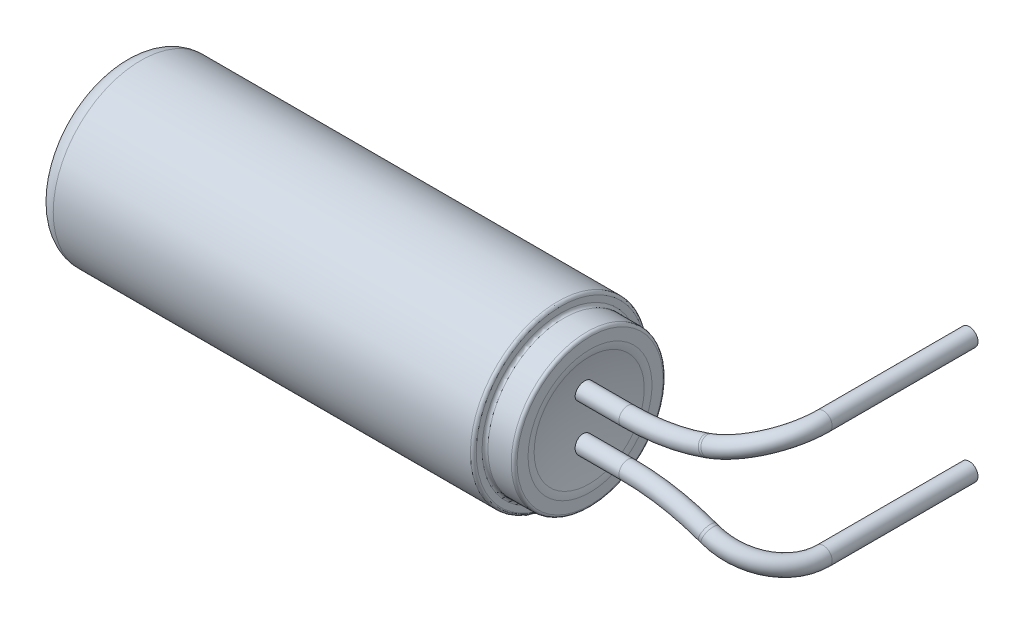
ISO-10303-21;
HEADER;
FILE_DESCRIPTION(('STEP AP214'),'2;1');
FILE_NAME('part.step','',(''),(''),'','','');
FILE_SCHEMA(('AUTOMOTIVE_DESIGN { 1 0 10303 214 1 1 1 1 }'));
ENDSEC;
DATA;
#1=APPLICATION_CONTEXT('core data for automotive mechanical design processes');
#2=APPLICATION_PROTOCOL_DEFINITION('international standard','automotive_design',2000,#1);
#3=PRODUCT_CONTEXT('',#1,'mechanical');
#4=PRODUCT('Part','Part','',(#3));
#5=PRODUCT_RELATED_PRODUCT_CATEGORY('part','',(#4));
#6=PRODUCT_DEFINITION_FORMATION('','',#4);
#7=PRODUCT_DEFINITION_CONTEXT('part definition',#1,'design');
#8=PRODUCT_DEFINITION('design','',#6,#7);
#9=PRODUCT_DEFINITION_SHAPE('','',#8);
#10=(LENGTH_UNIT() NAMED_UNIT(*) SI_UNIT(.MILLI.,.METRE.));
#11=(NAMED_UNIT(*) PLANE_ANGLE_UNIT() SI_UNIT($,.RADIAN.));
#12=(NAMED_UNIT(*) SI_UNIT($,.STERADIAN.) SOLID_ANGLE_UNIT());
#13=UNCERTAINTY_MEASURE_WITH_UNIT(LENGTH_MEASURE(1.E-05),#10,'distance_accuracy_value','');
#14=(GEOMETRIC_REPRESENTATION_CONTEXT(3) GLOBAL_UNCERTAINTY_ASSIGNED_CONTEXT((#13)) GLOBAL_UNIT_ASSIGNED_CONTEXT((#10,
#11,#12)) REPRESENTATION_CONTEXT('',''));
#15=CARTESIAN_POINT('',(0.,0.,0.));
#16=DIRECTION('',(0.,0.,1.));
#17=DIRECTION('',(1.,0.,0.));
#18=AXIS2_PLACEMENT_3D('',#15,#16,#17);
#19=CARTESIAN_POINT('',(-10.7,0.,1.5));
#20=DIRECTION('',(-1.,0.,0.));
#21=DIRECTION('',(0.,0.,1.));
#22=AXIS2_PLACEMENT_3D('',#19,#20,#21);
#23=TOROIDAL_SURFACE('',#22,1.2,0.3);
#24=CARTESIAN_POINT('',(-10.7,0.,1.5));
#25=DIRECTION('',(-1.,0.,0.));
#26=DIRECTION('',(0.,0.,1.));
#27=AXIS2_PLACEMENT_3D('',#24,#25,#26);
#28=CIRCLE('',#27,1.5);
#29=CARTESIAN_POINT('',(-10.7,0.,3.));
#30=VERTEX_POINT('',#29);
#31=EDGE_CURVE('E80',#30,#30,#28,.T.);
#32=ORIENTED_EDGE('',*,*,#31,.T.);
#33=EDGE_LOOP('',(#32));
#34=FACE_BOUND('',#33,.T.);
#35=CARTESIAN_POINT('',(-11.,0.,1.5));
#36=DIRECTION('',(-1.,0.,0.));
#37=DIRECTION('',(0.,0.,1.));
#38=AXIS2_PLACEMENT_3D('',#35,#36,#37);
#39=CIRCLE('',#38,1.2);
#40=CARTESIAN_POINT('',(-11.,0.,2.7));
#41=VERTEX_POINT('',#40);
#42=EDGE_CURVE('E107',#41,#41,#39,.T.);
#43=ORIENTED_EDGE('',*,*,#42,.F.);
#44=EDGE_LOOP('',(#43));
#45=FACE_BOUND('',#44,.T.);
#46=ADVANCED_FACE('F37',(#34,#45),#23,.T.);
#47=CARTESIAN_POINT('',(-11.,0.,2.7));
#48=DIRECTION('',(-1.,0.,0.));
#49=DIRECTION('',(0.,0.,1.));
#50=AXIS2_PLACEMENT_3D('',#47,#48,#49);
#51=PLANE('',#50);
#52=ORIENTED_EDGE('',*,*,#42,.T.);
#53=EDGE_LOOP('',(#52));
#54=FACE_BOUND('',#53,.T.);
#55=ADVANCED_FACE('F176',(#54),#51,.T.);
#56=CARTESIAN_POINT('',(0.872983346207417,0.,1.5));
#57=DIRECTION('',(-1.,0.,0.));
#58=DIRECTION('',(0.,0.,1.));
#59=AXIS2_PLACEMENT_3D('',#56,#57,#58);
#60=SPHERICAL_SURFACE('',#59,4.);
#61=CARTESIAN_POINT('',(-3.09334051928466,-0.507218742534798,1.39509937440816));
#62=CARTESIAN_POINT('',(-3.09393685361292,-0.501305603432375,1.38905611296728));
#63=CARTESIAN_POINT('',(-3.09458489583757,-0.49487840158325,1.38351201035815));
#64=CARTESIAN_POINT('',(-3.09596541710744,-0.4811827386441,1.37358373849689));
#65=CARTESIAN_POINT('',(-3.0966980019741,-0.473913223189062,1.36920104608264));
#66=CARTESIAN_POINT('',(-3.09822560482298,-0.458750061738159,1.36172563136943));
#67=CARTESIAN_POINT('',(-3.09902058119486,-0.450856831688512,1.35863205786989));
#68=CARTESIAN_POINT('',(-3.1006504590062,-0.434668807085768,1.35381731161488));
#69=CARTESIAN_POINT('',(-3.10148535035421,-0.426374114025604,1.35209579389564));
#70=CARTESIAN_POINT('',(-3.10317415945367,-0.409590256308292,1.35006773309764));
#71=CARTESIAN_POINT('',(-3.10402812601833,-0.40110059065062,1.34976537422038));
#72=CARTESIAN_POINT('',(-3.10572854587596,-0.384190503562251,1.35059542925992));
#73=CARTESIAN_POINT('',(-3.1065749987697,-0.375770085812762,1.35172791896312));
#74=CARTESIAN_POINT('',(-3.10823742791311,-0.359227299775291,1.35539896819881));
#75=CARTESIAN_POINT('',(-3.1090533653927,-0.351105310858813,1.35793925562216));
#76=CARTESIAN_POINT('',(-3.11063045217837,-0.335402159674445,1.36435686295868));
#77=CARTESIAN_POINT('',(-3.11139160193495,-0.327820992959561,1.36823417187646));
#78=CARTESIAN_POINT('',(-3.11283591393656,-0.313431683414022,1.37720878632798));
#79=CARTESIAN_POINT('',(-3.11351922852225,-0.306622030704726,1.38230364608068));
#80=CARTESIAN_POINT('',(-3.11479000338356,-0.293955146118108,1.39357465127481));
#81=CARTESIAN_POINT('',(-3.11537746592087,-0.288097891768141,1.39975077119585));
#82=CARTESIAN_POINT('',(-3.1164372292288,-0.277529690873863,1.41298051456669));
#83=CARTESIAN_POINT('',(-3.11691002022661,-0.27281386484495,1.4200302007101));
#84=CARTESIAN_POINT('',(-3.11773005314371,-0.264633416418267,1.43482824809174));
#85=CARTESIAN_POINT('',(-3.11807729837158,-0.261168761047602,1.44257659091109));
#86=CARTESIAN_POINT('',(-3.11863478318374,-0.255605983704369,1.45851205277183));
#87=CARTESIAN_POINT('',(-3.11884567140727,-0.253501392044791,1.46669689095527));
#88=CARTESIAN_POINT('',(-3.11912696005609,-0.250694153424214,1.48330586232269));
#89=CARTESIAN_POINT('',(-3.11919736349164,-0.249991476423336,1.49172999037531));
#90=CARTESIAN_POINT('',(-3.11919564242301,-0.250008653384269,1.50855030235141));
#91=CARTESIAN_POINT('',(-3.11912396318907,-0.250724063230081,1.51694649123628));
#92=CARTESIAN_POINT('',(-3.11884104456068,-0.253547566284006,1.53349883451104));
#93=CARTESIAN_POINT('',(-3.11862980592329,-0.255655651937392,1.54165499020276));
#94=CARTESIAN_POINT('',(-3.11807389713144,-0.261202696371296,1.55749542622673));
#95=CARTESIAN_POINT('',(-3.11772924203568,-0.26464150495324,1.56517975970013));
#96=CARTESIAN_POINT('',(-3.11691638855127,-0.272750338835129,1.5798614630305));
#97=CARTESIAN_POINT('',(-3.11644818870354,-0.27742037867619,1.58685882477284));
#98=CARTESIAN_POINT('',(-3.11540003393559,-0.287872859536257,1.59999067770041));
#99=CARTESIAN_POINT('',(-3.1148197546915,-0.293658528766541,1.60612257313213));
#100=CARTESIAN_POINT('',(-3.11356480754707,-0.306167763427729,1.61732873409954));
#101=CARTESIAN_POINT('',(-3.11289013737699,-0.312891351411894,1.62240297419547));
#102=CARTESIAN_POINT('',(-3.11146203414788,-0.327119403044731,1.63137535990459));
#103=CARTESIAN_POINT('',(-3.11070824457522,-0.334627400488884,1.63526784496861));
#104=CARTESIAN_POINT('',(-3.10914581449248,-0.35018494660467,1.64173721747279));
#105=CARTESIAN_POINT('',(-3.10833717256312,-0.358234509289021,1.64431407085684));
#106=CARTESIAN_POINT('',(-3.1066840371301,-0.374685254772762,1.64809017558273));
#107=CARTESIAN_POINT('',(-3.105839399731,-0.383087846486268,1.64928322752164));
#108=CARTESIAN_POINT('',(-3.10414151852325,-0.399973163756694,1.65023817509612));
#109=CARTESIAN_POINT('',(-3.10328827456612,-0.408455890695997,1.65000004599775));
#110=CARTESIAN_POINT('',(-3.10159536836937,-0.425280949843948,1.64809696161685));
#111=CARTESIAN_POINT('',(-3.1007557413197,-0.433622920027478,1.64642877170701));
#112=CARTESIAN_POINT('',(-3.09911599540536,-0.449909366289048,1.64170723288585));
#113=CARTESIAN_POINT('',(-3.09831587649801,-0.45785384279643,1.6386538854707));
#114=CARTESIAN_POINT('',(-3.09677884161503,-0.473110953593779,1.63125021263073));
#115=CARTESIAN_POINT('',(-3.09604186664766,-0.480424177674931,1.6269011151437));
#116=CARTESIAN_POINT('',(-3.09465160320177,-0.494216740350828,1.61702623008689));
#117=CARTESIAN_POINT('',(-3.09399831341775,-0.500696091953928,1.61150046087669));
#118=CARTESIAN_POINT('',(-3.09279680386172,-0.512610202204708,1.59945077967352));
#119=CARTESIAN_POINT('',(-3.0922481969463,-0.518048810005548,1.5929307124827));
#120=CARTESIAN_POINT('',(-3.09126912171042,-0.527753263908819,1.57906155612166));
#121=CARTESIAN_POINT('',(-3.0908386504108,-0.532019139585589,1.57171248786406));
#122=CARTESIAN_POINT('',(-3.09011041581579,-0.53923495753865,1.55643280664455));
#123=CARTESIAN_POINT('',(-3.08981200964224,-0.542191274663863,1.54850523468547));
#124=CARTESIAN_POINT('',(-3.08935367533647,-0.546731725937848,1.53226295041383));
#125=CARTESIAN_POINT('',(-3.08919373828762,-0.548315948441895,1.52394826306569));
#126=CARTESIAN_POINT('',(-3.08901743195343,-0.550062302178969,1.50720331238151));
#127=CARTESIAN_POINT('',(-3.08900048824616,-0.550230123271981,1.49877364785549));
#128=CARTESIAN_POINT('',(-3.0891091930225,-0.549153391757907,1.48200368515588));
#129=CARTESIAN_POINT('',(-3.08923487565208,-0.547908500935588,1.47366340886522));
#130=CARTESIAN_POINT('',(-3.08962496547309,-0.544044257377438,1.45731784803167));
#131=CARTESIAN_POINT('',(-3.08988927973495,-0.54142582537353,1.44931234295683));
#132=CARTESIAN_POINT('',(-3.09054865637416,-0.534892715634954,1.43386272743837));
#133=CARTESIAN_POINT('',(-3.09094356105825,-0.530979601279205,1.42641795313695));
#134=CARTESIAN_POINT('',(-3.09167838607879,-0.523696783446933,1.41499432179749));
#135=CARTESIAN_POINT('',(-3.09198175043253,-0.520689859266182,1.4107772609097));
#136=CARTESIAN_POINT('',(-3.09263046996662,-0.514258958067569,1.40267769564644));
#137=CARTESIAN_POINT('',(-3.09297582510564,-0.510834981460287,1.39879519094162));
#138=CARTESIAN_POINT('',(-3.09334051928466,-0.507218742534798,1.39509937440816));
#139=B_SPLINE_CURVE_WITH_KNOTS('',3,(#61,#62,#63,#64,#65,#66,#67,#68,#69,#70,#71,#72,#73,#74,
#75,#76,#77,#78,#79,#80,#81,#82,#83,#84,#85,#86,#87,#88,#89,#90,#91,#92,#93,#94,#95,#96,#97,#98,
#99,#100,#101,#102,#103,#104,#105,#106,#107,#108,#109,#110,#111,#112,#113,#114,#115,#116,#117,
#118,#119,#120,#121,#122,#123,#124,#125,#126,#127,#128,#129,#130,#131,#132,#133,#134,#135,#136,
#137,#138),.UNSPECIFIED.,.T.,.F.,(4,2,2,2,2,2,2,2,2,2,2,2,2,2,2,2,2,2,2,2,2,2,2,2,2,2,2,2,2,2,2,
2,2,2,2,2,2,2,4),(0.,0.0254088404096152,0.0508498370786933,0.0762740084283123,0.101691785586518,
0.127184456809215,0.152678474570053,0.178203852485399,0.203729020490218,0.229203339005918,
0.254677056346245,0.280039872790839,0.305402020784238,0.33064261779019,0.355882673941097,
0.381043755802405,0.406204701175695,0.431362807463327,0.4565212108871,0.481753536370812,
0.50698646869746,0.532338424955898,0.557691037435457,0.583156795697729,0.608622994065576,
0.634146946384952,0.659670871134663,0.685170684262066,0.710670099545861,0.736073301926456,
0.761475863622043,0.786753370575172,0.812029249676156,0.837203543869428,0.8623838662743,
0.887547330971636,0.91268052004348,0.92821956396022,0.943758592579238),.UNSPECIFIED.);
#140=CARTESIAN_POINT('',(-3.09334051928466,-0.507218742534798,1.39509937440816));
#141=VERTEX_POINT('',#140);
#142=EDGE_CURVE('E11',#141,#141,#139,.T.);
#143=ORIENTED_EDGE('',*,*,#142,.F.);
#144=EDGE_LOOP('',(#143));
#145=FACE_BOUND('',#144,.T.);
#146=CARTESIAN_POINT('',(-3.1145642822253,0.296198543157012,1.39171592432362));
#147=CARTESIAN_POINT('',(-3.11395171942412,0.302303411315903,1.38586408628695));
#148=CARTESIAN_POINT('',(-3.11328976473582,0.308906820442287,1.38052830259324));
#149=CARTESIAN_POINT('',(-3.11188408496075,0.322917218909998,1.37104294216834));
#150=CARTESIAN_POINT('',(-3.11114025717481,0.330325217346111,1.36689487930402));
#151=CARTESIAN_POINT('',(-3.10959379976927,0.345724264386102,1.35990872783056));
#152=CARTESIAN_POINT('',(-3.10879120905192,0.353714927240262,1.35706978148539));
#153=CARTESIAN_POINT('',(-3.10714952506058,0.37005390485663,1.35277713988263));
#154=CARTESIAN_POINT('',(-3.10631044113552,0.37840212800984,1.35132309199843));
#155=CARTESIAN_POINT('',(-3.1046168513958,0.39524669208122,1.34983645582526));
#156=CARTESIAN_POINT('',(-3.1037623088214,0.403743383761958,1.34980787996193));
#157=CARTESIAN_POINT('',(-3.10206425747467,0.420621598034769,1.35118317759248));
#158=CARTESIAN_POINT('',(-3.10122074928944,0.429003114499867,1.35258712699572));
#159=CARTESIAN_POINT('',(-3.09956795905177,0.445421010844736,1.35679104031872));
#160=CARTESIAN_POINT('',(-3.09875871169516,0.453457040973331,1.35959238434386));
#161=CARTESIAN_POINT('',(-3.09719853488951,0.468945551050947,1.36651419575383));
#162=CARTESIAN_POINT('',(-3.09644760485609,0.476398036847529,1.37063464991807));
#163=CARTESIAN_POINT('',(-3.095027365615,0.49048936832898,1.38006915205834));
#164=CARTESIAN_POINT('',(-3.094357878754,0.497129985121268,1.38538052753419));
#165=CARTESIAN_POINT('',(-3.09311809287158,0.509424700191347,1.39705301830606));
#166=CARTESIAN_POINT('',(-3.09254779141777,0.515078822661476,1.40341410785193));
#167=CARTESIAN_POINT('',(-3.09152547568877,0.525212577583423,1.4169750784145));
#168=CARTESIAN_POINT('',(-3.0910729407042,0.529697380403566,1.42417105632928));
#169=CARTESIAN_POINT('',(-3.09029616442995,0.537394590231246,1.43922045483236));
#170=CARTESIAN_POINT('',(-3.08997191971623,0.540607031197857,1.44707385786735));
#171=CARTESIAN_POINT('',(-3.08946259392076,0.545652795745341,1.4631747460953));
#172=CARTESIAN_POINT('',(-3.08927685433076,0.547492645189498,1.47142016567376));
#173=CARTESIAN_POINT('',(-3.08904750747567,0.549764409878033,1.48810461706025));
#174=CARTESIAN_POINT('',(-3.0890038972774,0.550196354177885,1.4965436448691));
#175=CARTESIAN_POINT('',(-3.08906001730841,0.549640482895645,1.51334936944924));
#176=CARTESIAN_POINT('',(-3.08915932654705,0.548656837146435,1.52171620592173));
#177=CARTESIAN_POINT('',(-3.08949758394307,0.545306133101512,1.53816511105617));
#178=CARTESIAN_POINT('',(-3.08973653157566,0.542939080004836,1.54624718078817));
#179=CARTESIAN_POINT('',(-3.0903470908924,0.53688992371052,1.5618996115037));
#180=CARTESIAN_POINT('',(-3.09071872955646,0.533207553070756,1.56946986804823));
#181=CARTESIAN_POINT('',(-3.09158379498769,0.524634461634888,1.58388428237692));
#182=CARTESIAN_POINT('',(-3.0920772234164,0.519743724353386,1.59072843025318));
#183=CARTESIAN_POINT('',(-3.09317336187536,0.508876584275354,1.603520778796));
#184=CARTESIAN_POINT('',(-3.09377642104715,0.502896712790098,1.60946600253973));
#185=CARTESIAN_POINT('',(-3.0950733659946,0.49003293561403,1.62026895511129));
#186=CARTESIAN_POINT('',(-3.09576725405211,0.483149007211053,1.62512665660957));
#187=CARTESIAN_POINT('',(-3.09722963023452,0.468636822671804,1.6336417021243));
#188=CARTESIAN_POINT('',(-3.0979984636957,0.461005119991299,1.63729311293659));
#189=CARTESIAN_POINT('',(-3.09958599242298,0.445241849215606,1.6432627309423));
#190=CARTESIAN_POINT('',(-3.10040468896314,0.437110268347973,1.64558090405431));
#191=CARTESIAN_POINT('',(-3.10207244008268,0.42054024233568,1.6488276894471));
#192=CARTESIAN_POINT('',(-3.10292161081785,0.4121006203667,1.64975023812621));
#193=CARTESIAN_POINT('',(-3.10462288348355,0.395186756433259,1.65016123904573));
#194=CARTESIAN_POINT('',(-3.1054749854596,0.386712513930717,1.64964966891139));
#195=CARTESIAN_POINT('',(-3.10715966863345,0.369952865673255,1.64720401715882));
#196=CARTESIAN_POINT('',(-3.10799220903783,0.361667855398102,1.64526719546725));
#197=CARTESIAN_POINT('',(-3.10961241624235,0.345539562157512,1.64002131927407));
#198=CARTESIAN_POINT('',(-3.11040008319052,0.337696277734963,1.63671226929931));
#199=CARTESIAN_POINT('',(-3.11190708950742,0.32268597886494,1.62881905814514));
#200=CARTESIAN_POINT('',(-3.11262651765355,0.315518085828446,1.62423658505332));
#201=CARTESIAN_POINT('',(-3.11397761558378,0.302053432968252,1.6139227087943));
#202=CARTESIAN_POINT('',(-3.11460928686542,0.295756658279011,1.6081913252372));
#203=CARTESIAN_POINT('',(-3.11576433170286,0.28424036883589,1.59576625136609));
#204=CARTESIAN_POINT('',(-3.11628812655427,0.279016663579743,1.58907648452015));
#205=CARTESIAN_POINT('',(-3.11721543267343,0.269767400954383,1.57490691027422));
#206=CARTESIAN_POINT('',(-3.11761894699576,0.265741813158315,1.56742712294377));
#207=CARTESIAN_POINT('',(-3.11829230230495,0.259023514059853,1.55192896851595));
#208=CARTESIAN_POINT('',(-3.11856278421647,0.256324412052867,1.5439133993697));
#209=CARTESIAN_POINT('',(-3.11896514064073,0.252309148048829,1.52754006591962));
#210=CARTESIAN_POINT('',(-3.11909702381516,0.250992899630808,1.51918232303374));
#211=CARTESIAN_POINT('',(-3.11921814432179,0.249784082393872,1.50239512963799));
#212=CARTESIAN_POINT('',(-3.11920791429072,0.249886197583502,1.49396606515406));
#213=CARTESIAN_POINT('',(-3.11904635795401,0.25149854460464,1.47724282857895));
#214=CARTESIAN_POINT('',(-3.11889499783729,0.253009113864988,1.46894868929682));
#215=CARTESIAN_POINT('',(-3.1184556822542,0.257393217265727,1.45273662388368));
#216=CARTESIAN_POINT('',(-3.11816777326227,0.26026628767872,1.4448185707597));
#217=CARTESIAN_POINT('',(-3.11746374243715,0.267289990652041,1.42958517615376));
#218=CARTESIAN_POINT('',(-3.11704777465283,0.27143908820394,1.42226912382116));
#219=CARTESIAN_POINT('',(-3.11628132685001,0.279084787894781,1.41108216311238));
#220=CARTESIAN_POINT('',(-3.11596639331185,0.282226556038682,1.40696163521177));
#221=CARTESIAN_POINT('',(-3.11529522789639,0.288916214246537,1.39906834543739));
#222=CARTESIAN_POINT('',(-3.11493899616987,0.292464102827853,1.39529558229412));
#223=CARTESIAN_POINT('',(-3.1145642822253,0.296198543157012,1.39171592432362));
#224=B_SPLINE_CURVE_WITH_KNOTS('',3,(#146,#147,#148,#149,#150,#151,#152,#153,#154,#155,#156,
#157,#158,#159,#160,#161,#162,#163,#164,#165,#166,#167,#168,#169,#170,#171,#172,#173,#174,#175,
#176,#177,#178,#179,#180,#181,#182,#183,#184,#185,#186,#187,#188,#189,#190,#191,#192,#193,#194,
#195,#196,#197,#198,#199,#200,#201,#202,#203,#204,#205,#206,#207,#208,#209,#210,#211,#212,#213,
#214,#215,#216,#217,#218,#219,#220,#221,#222,#223),.UNSPECIFIED.,.T.,.F.,(4,2,2,2,2,2,2,2,2,2,2,
2,2,2,2,2,2,2,2,2,2,2,2,2,2,2,2,2,2,2,2,2,2,2,2,2,2,2,4),(0.,0.0254171780547001,
0.0508666100356368,0.0762993437168472,0.101725599913773,0.12722342203462,0.152722595352436,
0.17824700236487,0.203771153570431,0.22923859030397,0.254705402397868,0.280057621561178,
0.305409164033408,0.330639392994324,0.355869101266097,0.381024643588311,0.406180091373114,
0.431340656902799,0.456501565709797,0.481744054909467,0.506987178384789,0.532352674452752,
0.557718818906979,0.583194858870129,0.608671296306218,0.634196841065381,0.659722301619049,
0.685214084965121,0.710705433242964,0.736095257675788,0.761484437264958,0.786750068292876,
0.812014120259758,0.837183508822141,0.86235892886295,0.887525786589881,0.912662487259144,
0.928210616854225,0.94375868968896),.UNSPECIFIED.);
#225=CARTESIAN_POINT('',(-3.1145642822253,0.296198543157012,1.39171592432362));
#226=VERTEX_POINT('',#225);
#227=EDGE_CURVE('E48',#226,#226,#224,.T.);
#228=ORIENTED_EDGE('',*,*,#227,.F.);
#229=EDGE_LOOP('',(#228));
#230=FACE_BOUND('',#229,.T.);
#231=CARTESIAN_POINT('',(-3.01411296153242,0.,1.5));
#232=DIRECTION('',(-1.,0.,0.));
#233=DIRECTION('',(0.,0.,1.));
#234=AXIS2_PLACEMENT_3D('',#231,#232,#233);
#235=CIRCLE('',#234,0.943653694082017);
#236=CARTESIAN_POINT('',(-3.01411296153242,0.,2.44365369408202));
#237=VERTEX_POINT('',#236);
#238=EDGE_CURVE('E104',#237,#237,#235,.T.);
#239=ORIENTED_EDGE('',*,*,#238,.F.);
#240=EDGE_LOOP('',(#239));
#241=FACE_BOUND('',#240,.T.);
#242=ADVANCED_FACE('F113',(#145,#230,#241),#60,.F.);
#243=CARTESIAN_POINT('',(-3.5,0.,1.5));
#244=DIRECTION('',(-1.,0.,0.));
#245=DIRECTION('',(0.,0.,1.));
#246=AXIS2_PLACEMENT_3D('',#243,#244,#245);
#247=TOROIDAL_SURFACE('',#246,1.06161040584227,0.5);
#248=ORIENTED_EDGE('',*,*,#238,.T.);
#249=EDGE_LOOP('',(#248));
#250=FACE_BOUND('',#249,.T.);
#251=CARTESIAN_POINT('',(-2.99999999999989,0.,1.5));
#252=DIRECTION('',(-1.,0.,0.));
#253=DIRECTION('',(0.,0.,1.));
#254=AXIS2_PLACEMENT_3D('',#251,#252,#253);
#255=CIRCLE('',#254,1.06161040584227);
#256=CARTESIAN_POINT('',(-2.99999999999989,0.,2.56161040584227));
#257=VERTEX_POINT('',#256);
#258=EDGE_CURVE('E101',#257,#257,#255,.T.);
#259=ORIENTED_EDGE('',*,*,#258,.F.);
#260=EDGE_LOOP('',(#259));
#261=FACE_BOUND('',#260,.T.);
#262=ADVANCED_FACE('F169',(#250,#261),#247,.T.);
#263=CARTESIAN_POINT('',(-3.,0.,2.56161040584227));
#264=DIRECTION('',(1.,0.,0.));
#265=DIRECTION('',(0.,0.,-1.));
#266=AXIS2_PLACEMENT_3D('',#263,#264,#265);
#267=PLANE('',#266);
#268=ORIENTED_EDGE('',*,*,#258,.T.);
#269=EDGE_LOOP('',(#268));
#270=FACE_BOUND('',#269,.T.);
#271=CARTESIAN_POINT('',(-2.99999999999989,0.,1.5));
#272=DIRECTION('',(-1.,0.,0.));
#273=DIRECTION('',(0.,0.,1.));
#274=AXIS2_PLACEMENT_3D('',#271,#272,#273);
#275=CIRCLE('',#274,1.25);
#276=CARTESIAN_POINT('',(-2.99999999999989,0.,2.75));
#277=VERTEX_POINT('',#276);
#278=EDGE_CURVE('E98',#277,#277,#275,.T.);
#279=ORIENTED_EDGE('',*,*,#278,.F.);
#280=EDGE_LOOP('',(#279));
#281=FACE_BOUND('',#280,.T.);
#282=ADVANCED_FACE('F166',(#270,#281),#267,.T.);
#283=CARTESIAN_POINT('',(-3.05,0.,1.5));
#284=DIRECTION('',(-1.,0.,0.));
#285=DIRECTION('',(0.,0.,1.));
#286=AXIS2_PLACEMENT_3D('',#283,#284,#285);
#287=TOROIDAL_SURFACE('',#286,1.25,0.0499999999999999);
#288=ORIENTED_EDGE('',*,*,#278,.T.);
#289=EDGE_LOOP('',(#288));
#290=FACE_BOUND('',#289,.T.);
#291=CARTESIAN_POINT('',(-3.05,0.,1.5));
#292=DIRECTION('',(-1.,0.,0.));
#293=DIRECTION('',(0.,0.,1.));
#294=AXIS2_PLACEMENT_3D('',#291,#292,#293);
#295=CIRCLE('',#294,1.3);
#296=CARTESIAN_POINT('',(-3.05,0.,2.8));
#297=VERTEX_POINT('',#296);
#298=EDGE_CURVE('E95',#297,#297,#295,.T.);
#299=ORIENTED_EDGE('',*,*,#298,.F.);
#300=EDGE_LOOP('',(#299));
#301=FACE_BOUND('',#300,.T.);
#302=ADVANCED_FACE('F162',(#290,#301),#287,.T.);
#303=CARTESIAN_POINT('',(-1006.26788641906,0.,1.5));
#304=DIRECTION('',(-1.,0.,0.));
#305=DIRECTION('',(0.,0.,1.));
#306=AXIS2_PLACEMENT_3D('',#303,#304,#305);
#307=CYLINDRICAL_SURFACE('',#306,1.3);
#308=ORIENTED_EDGE('',*,*,#298,.T.);
#309=EDGE_LOOP('',(#308));
#310=FACE_BOUND('',#309,.T.);
#311=CARTESIAN_POINT('',(-3.44999999999995,0.,1.5));
#312=DIRECTION('',(-1.,0.,0.));
#313=DIRECTION('',(0.,0.,1.));
#314=AXIS2_PLACEMENT_3D('',#311,#312,#313);
#315=CIRCLE('',#314,1.3);
#316=CARTESIAN_POINT('',(-3.44999999999995,0.,2.8));
#317=VERTEX_POINT('',#316);
#318=EDGE_CURVE('E92',#317,#317,#315,.T.);
#319=ORIENTED_EDGE('',*,*,#318,.F.);
#320=EDGE_LOOP('',(#319));
#321=FACE_BOUND('',#320,.T.);
#322=ADVANCED_FACE('F158',(#310,#321),#307,.T.);
#323=CARTESIAN_POINT('',(-3.45,0.,1.5));
#324=DIRECTION('',(-1.,0.,0.));
#325=DIRECTION('',(0.,0.,1.));
#326=AXIS2_PLACEMENT_3D('',#323,#324,#325);
#327=TOROIDAL_SURFACE('',#326,1.35,0.0500000000000001);
#328=ORIENTED_EDGE('',*,*,#318,.T.);
#329=EDGE_LOOP('',(#328));
#330=FACE_BOUND('',#329,.T.);
#331=CARTESIAN_POINT('',(-3.50000000000006,0.,1.5));
#332=DIRECTION('',(-1.,0.,0.));
#333=DIRECTION('',(0.,0.,1.));
#334=AXIS2_PLACEMENT_3D('',#331,#332,#333);
#335=CIRCLE('',#334,1.35);
#336=CARTESIAN_POINT('',(-3.50000000000006,0.,2.85));
#337=VERTEX_POINT('',#336);
#338=EDGE_CURVE('E89',#337,#337,#335,.T.);
#339=ORIENTED_EDGE('',*,*,#338,.F.);
#340=EDGE_LOOP('',(#339));
#341=FACE_BOUND('',#340,.T.);
#342=ADVANCED_FACE('F154',(#330,#341),#327,.F.);
#343=CARTESIAN_POINT('',(-3.5,0.,2.95));
#344=DIRECTION('',(1.,0.,0.));
#345=DIRECTION('',(0.,0.,-1.));
#346=AXIS2_PLACEMENT_3D('',#343,#344,#345);
#347=PLANE('',#346);
#348=ORIENTED_EDGE('',*,*,#338,.T.);
#349=EDGE_LOOP('',(#348));
#350=FACE_BOUND('',#349,.T.);
#351=CARTESIAN_POINT('',(-3.50000000000006,0.,1.5));
#352=DIRECTION('',(-1.,0.,0.));
#353=DIRECTION('',(0.,0.,1.));
#354=AXIS2_PLACEMENT_3D('',#351,#352,#353);
#355=CIRCLE('',#354,1.45);
#356=CARTESIAN_POINT('',(-3.50000000000006,0.,2.95));
#357=VERTEX_POINT('',#356);
#358=EDGE_CURVE('E86',#357,#357,#355,.T.);
#359=ORIENTED_EDGE('',*,*,#358,.F.);
#360=EDGE_LOOP('',(#359));
#361=FACE_BOUND('',#360,.T.);
#362=ADVANCED_FACE('F150',(#350,#361),#347,.T.);
#363=CARTESIAN_POINT('',(-3.55,0.,1.5));
#364=DIRECTION('',(-1.,0.,0.));
#365=DIRECTION('',(0.,0.,1.));
#366=AXIS2_PLACEMENT_3D('',#363,#364,#365);
#367=TOROIDAL_SURFACE('',#366,1.45,0.0500000000000001);
#368=ORIENTED_EDGE('',*,*,#358,.T.);
#369=EDGE_LOOP('',(#368));
#370=FACE_BOUND('',#369,.T.);
#371=CARTESIAN_POINT('',(-3.54999999999994,0.,1.5));
#372=DIRECTION('',(-1.,0.,0.));
#373=DIRECTION('',(0.,0.,1.));
#374=AXIS2_PLACEMENT_3D('',#371,#372,#373);
#375=CIRCLE('',#374,1.5);
#376=CARTESIAN_POINT('',(-3.54999999999994,0.,3.));
#377=VERTEX_POINT('',#376);
#378=EDGE_CURVE('E83',#377,#377,#375,.T.);
#379=ORIENTED_EDGE('',*,*,#378,.F.);
#380=EDGE_LOOP('',(#379));
#381=FACE_BOUND('',#380,.T.);
#382=ADVANCED_FACE('F146',(#370,#381),#367,.T.);
#383=CARTESIAN_POINT('',(-1006.26788641906,0.,1.5));
#384=DIRECTION('',(-1.,0.,0.));
#385=DIRECTION('',(0.,0.,1.));
#386=AXIS2_PLACEMENT_3D('',#383,#384,#385);
#387=CYLINDRICAL_SURFACE('',#386,1.5);
#388=ORIENTED_EDGE('',*,*,#378,.T.);
#389=EDGE_LOOP('',(#388));
#390=FACE_BOUND('',#389,.T.);
#391=ORIENTED_EDGE('',*,*,#31,.F.);
#392=EDGE_LOOP('',(#391));
#393=FACE_BOUND('',#392,.T.);
#394=ADVANCED_FACE('F140',(#390,#393),#387,.T.);
#395=CARTESIAN_POINT('',(0.,1.,-2.));
#396=DIRECTION('',(0.,0.,-1.));
#397=DIRECTION('',(-0.939692620785908,-0.342020143325669,0.));
#398=AXIS2_PLACEMENT_3D('',#395,#396,#397);
#399=PLANE('',#398);
#400=CARTESIAN_POINT('',(0.,1.,-2.));
#401=DIRECTION('',(0.,0.,-1.));
#402=DIRECTION('',(-0.939692620785908,-0.342020143325669,0.));
#403=AXIS2_PLACEMENT_3D('',#400,#401,#402);
#404=CIRCLE('',#403,0.15);
#405=CARTESIAN_POINT('',(-0.140953893117886,0.94869697850115,-2.));
#406=VERTEX_POINT('',#405);
#407=EDGE_CURVE('E53',#406,#406,#404,.T.);
#408=ORIENTED_EDGE('',*,*,#407,.T.);
#409=EDGE_LOOP('',(#408));
#410=FACE_BOUND('',#409,.T.);
#411=ADVANCED_FACE('F122',(#410),#399,.T.);
#412=CARTESIAN_POINT('',(-4.,0.4,1.5));
#413=DIRECTION('',(1.,0.,0.));
#414=DIRECTION('',(0.,1.,0.));
#415=AXIS2_PLACEMENT_3D('',#412,#413,#414);
#416=CYLINDRICAL_SURFACE('',#415,0.15);
#417=ORIENTED_EDGE('',*,*,#227,.T.);
#418=EDGE_LOOP('',(#417));
#419=FACE_BOUND('',#418,.T.);
#420=CARTESIAN_POINT('',(-2.35379437450663,0.4,1.5));
#421=DIRECTION('',(1.,0.,0.));
#422=DIRECTION('',(0.,0.,-1.));
#423=AXIS2_PLACEMENT_3D('',#420,#421,#422);
#424=CIRCLE('',#423,0.15);
#425=CARTESIAN_POINT('',(-2.35379437450663,0.25,1.5));
#426=VERTEX_POINT('',#425);
#427=EDGE_CURVE('E60',#426,#426,#424,.T.);
#428=ORIENTED_EDGE('',*,*,#427,.F.);
#429=EDGE_LOOP('',(#428));
#430=FACE_BOUND('',#429,.T.);
#431=ADVANCED_FACE('F116',(#419,#430),#416,.T.);
#432=CARTESIAN_POINT('',(-2.35379437450663,4.4,1.5));
#433=DIRECTION('',(0.,0.,1.));
#434=DIRECTION('',(1.,0.,0.));
#435=AXIS2_PLACEMENT_3D('',#432,#433,#434);
#436=TOROIDAL_SURFACE('',#435,4.,0.15);
#437=CARTESIAN_POINT('',(-0.985713801203955,0.641229516856367,1.5));
#438=DIRECTION('',(0.939692620785908,0.342020143325669,0.));
#439=DIRECTION('',(0.,0.,-1.));
#440=AXIS2_PLACEMENT_3D('',#437,#438,#439);
#441=CIRCLE('',#440,0.15);
#442=CARTESIAN_POINT('',(-0.934410779705105,0.500275623738481,1.5));
#443=VERTEX_POINT('',#442);
#444=EDGE_CURVE('E64',#443,#443,#441,.T.);
#445=CARTESIAN_POINT('',(-2.35379437450663,4.4,1.5));
#446=DIRECTION('',(0.,0.,1.));
#447=DIRECTION('',(1.,0.,0.));
#448=AXIS2_PLACEMENT_3D('',#445,#446,#447);
#449=CIRCLE('',#448,4.15);
#450=EDGE_CURVE('',#426,#443,#449,.T.);
#451=ORIENTED_EDGE('',*,*,#427,.T.);
#452=ORIENTED_EDGE('',*,*,#444,.F.);
#453=ORIENTED_EDGE('',*,*,#450,.T.);
#454=ORIENTED_EDGE('',*,*,#450,.F.);
#455=EDGE_LOOP('',(#451,#453,#452,#454));
#456=FACE_BOUND('',#455,.T.);
#457=ADVANCED_FACE('F121',(#456),#436,.T.);
#458=CARTESIAN_POINT('',(-0.985713801203955,0.641229516856367,1.5));
#459=DIRECTION('',(0.939692620785908,0.342020143325669,0.));
#460=DIRECTION('',(-0.342020143325669,0.939692620785908,0.));
#461=AXIS2_PLACEMENT_3D('',#458,#459,#460);
#462=CYLINDRICAL_SURFACE('',#461,0.15);
#463=CARTESIAN_POINT('',(-0.939692620785908,0.65797985667433,1.5));
#464=DIRECTION('',(0.939692620785908,0.342020143325669,0.));
#465=DIRECTION('',(0.,0.,-1.));
#466=AXIS2_PLACEMENT_3D('',#463,#464,#465);
#467=CIRCLE('',#466,0.15);
#468=CARTESIAN_POINT('',(-0.939692620785908,0.65797985667433,1.65));
#469=VERTEX_POINT('',#468);
#470=EDGE_CURVE('E73',#469,#469,#467,.T.);
#471=ORIENTED_EDGE('',*,*,#470,.F.);
#472=EDGE_LOOP('',(#471));
#473=FACE_BOUND('',#472,.T.);
#474=ORIENTED_EDGE('',*,*,#444,.T.);
#475=EDGE_LOOP('',(#474));
#476=FACE_BOUND('',#475,.T.);
#477=ADVANCED_FACE('F127',(#473,#476),#462,.T.);
#478=CARTESIAN_POINT('',(-0.939692620785908,0.65797985667433,0.5));
#479=DIRECTION('',(-0.342020143325669,0.939692620785908,0.));
#480=DIRECTION('',(-0.939692620785908,-0.342020143325669,0.));
#481=AXIS2_PLACEMENT_3D('',#478,#479,#480);
#482=TOROIDAL_SURFACE('',#481,1.,0.15);
#483=CARTESIAN_POINT('',(0.,1.,0.5));
#484=DIRECTION('',(0.,0.,-1.));
#485=DIRECTION('',(-0.939692620785908,-0.342020143325669,0.));
#486=AXIS2_PLACEMENT_3D('',#483,#484,#485);
#487=CIRCLE('',#486,0.15);
#488=CARTESIAN_POINT('',(0.140953893117886,1.05130302149885,0.5));
#489=VERTEX_POINT('',#488);
#490=EDGE_CURVE('E76',#489,#489,#487,.T.);
#491=CARTESIAN_POINT('',(-0.939692620785908,0.65797985667433,0.5));
#492=DIRECTION('',(-0.342020143325669,0.939692620785908,0.));
#493=DIRECTION('',(-0.939692620785908,-0.342020143325669,0.));
#494=AXIS2_PLACEMENT_3D('',#491,#492,#493);
#495=CIRCLE('',#494,1.15);
#496=EDGE_CURVE('',#469,#489,#495,.T.);
#497=ORIENTED_EDGE('',*,*,#470,.T.);
#498=ORIENTED_EDGE('',*,*,#490,.F.);
#499=ORIENTED_EDGE('',*,*,#496,.T.);
#500=ORIENTED_EDGE('',*,*,#496,.F.);
#501=EDGE_LOOP('',(#497,#499,#498,#500));
#502=FACE_BOUND('',#501,.T.);
#503=ADVANCED_FACE('F131',(#502),#482,.T.);
#504=CARTESIAN_POINT('',(0.,1.,0.5));
#505=DIRECTION('',(0.,0.,-1.));
#506=DIRECTION('',(-1.,0.,0.));
#507=AXIS2_PLACEMENT_3D('',#504,#505,#506);
#508=CYLINDRICAL_SURFACE('',#507,0.15);
#509=ORIENTED_EDGE('',*,*,#407,.F.);
#510=EDGE_LOOP('',(#509));
#511=FACE_BOUND('',#510,.T.);
#512=ORIENTED_EDGE('',*,*,#490,.T.);
#513=EDGE_LOOP('',(#512));
#514=FACE_BOUND('',#513,.T.);
#515=ADVANCED_FACE('F135',(#511,#514),#508,.T.);
#516=CARTESIAN_POINT('',(0.,-1.,-2.));
#517=DIRECTION('',(0.,0.,-1.));
#518=DIRECTION('',(-0.939692620785908,0.342020143325669,0.));
#519=AXIS2_PLACEMENT_3D('',#516,#517,#518);
#520=PLANE('',#519);
#521=CARTESIAN_POINT('',(0.,-1.,-2.));
#522=DIRECTION('',(0.,0.,1.));
#523=DIRECTION('',(-0.939692620785908,0.342020143325669,0.));
#524=AXIS2_PLACEMENT_3D('',#521,#522,#523);
#525=CIRCLE('',#524,0.15);
#526=CARTESIAN_POINT('',(-0.140953893117886,-0.94869697850115,-2.));
#527=VERTEX_POINT('',#526);
#528=EDGE_CURVE('E57',#527,#527,#525,.F.);
#529=ORIENTED_EDGE('',*,*,#528,.T.);
#530=EDGE_LOOP('',(#529));
#531=FACE_BOUND('',#530,.T.);
#532=ADVANCED_FACE('F58',(#531),#520,.T.);
#533=CARTESIAN_POINT('',(-4.,-0.4,1.5));
#534=DIRECTION('',(1.,0.,0.));
#535=DIRECTION('',(0.,1.,0.));
#536=AXIS2_PLACEMENT_3D('',#533,#534,#535);
#537=CYLINDRICAL_SURFACE('',#536,0.15);
#538=ORIENTED_EDGE('',*,*,#142,.T.);
#539=EDGE_LOOP('',(#538));
#540=FACE_BOUND('',#539,.T.);
#541=CARTESIAN_POINT('',(-2.35379437450663,-0.4,1.5));
#542=DIRECTION('',(-1.,0.,0.));
#543=DIRECTION('',(0.,0.,-1.));
#544=AXIS2_PLACEMENT_3D('',#541,#542,#543);
#545=CIRCLE('',#544,0.15);
#546=CARTESIAN_POINT('',(-2.35379437450663,-0.25,1.5));
#547=VERTEX_POINT('',#546);
#548=EDGE_CURVE('E344',#547,#547,#545,.F.);
#549=ORIENTED_EDGE('',*,*,#548,.F.);
#550=EDGE_LOOP('',(#549));
#551=FACE_BOUND('',#550,.T.);
#552=ADVANCED_FACE('F288',(#540,#551),#537,.T.);
#553=CARTESIAN_POINT('',(-2.35379437450663,-4.4,1.5));
#554=DIRECTION('',(0.,0.,-1.));
#555=DIRECTION('',(-1.,0.,0.));
#556=AXIS2_PLACEMENT_3D('',#553,#554,#555);
#557=TOROIDAL_SURFACE('',#556,4.,0.15);
#558=CARTESIAN_POINT('',(-0.985713801203955,-0.641229516856367,1.5));
#559=DIRECTION('',(-0.939692620785908,0.342020143325669,0.));
#560=DIRECTION('',(0.,0.,-1.));
#561=AXIS2_PLACEMENT_3D('',#558,#559,#560);
#562=CIRCLE('',#561,0.15);
#563=CARTESIAN_POINT('',(-0.934410779705105,-0.500275623738481,1.5));
#564=VERTEX_POINT('',#563);
#565=EDGE_CURVE('E342',#564,#564,#562,.F.);
#566=CARTESIAN_POINT('',(-2.35379437450663,-4.4,1.5));
#567=DIRECTION('',(0.,0.,-1.));
#568=DIRECTION('',(-1.,0.,0.));
#569=AXIS2_PLACEMENT_3D('',#566,#567,#568);
#570=CIRCLE('',#569,4.15);
#571=EDGE_CURVE('',#547,#564,#570,.T.);
#572=ORIENTED_EDGE('',*,*,#548,.T.);
#573=ORIENTED_EDGE('',*,*,#565,.F.);
#574=ORIENTED_EDGE('',*,*,#571,.T.);
#575=ORIENTED_EDGE('',*,*,#571,.F.);
#576=EDGE_LOOP('',(#572,#574,#573,#575));
#577=FACE_BOUND('',#576,.T.);
#578=ADVANCED_FACE('F293',(#577),#557,.T.);
#579=CARTESIAN_POINT('',(-0.985713801203955,-0.641229516856367,1.5));
#580=DIRECTION('',(0.939692620785908,-0.342020143325669,0.));
#581=DIRECTION('',(0.342020143325669,0.939692620785908,0.));
#582=AXIS2_PLACEMENT_3D('',#579,#580,#581);
#583=CYLINDRICAL_SURFACE('',#582,0.15);
#584=CARTESIAN_POINT('',(-0.939692620785908,-0.65797985667433,1.5));
#585=DIRECTION('',(-0.939692620785908,0.342020143325669,0.));
#586=DIRECTION('',(0.,0.,-1.));
#587=AXIS2_PLACEMENT_3D('',#584,#585,#586);
#588=CIRCLE('',#587,0.15);
#589=CARTESIAN_POINT('',(-0.939692620785908,-0.65797985667433,1.65));
#590=VERTEX_POINT('',#589);
#591=EDGE_CURVE('E67',#590,#590,#588,.F.);
#592=ORIENTED_EDGE('',*,*,#591,.F.);
#593=EDGE_LOOP('',(#592));
#594=FACE_BOUND('',#593,.T.);
#595=ORIENTED_EDGE('',*,*,#565,.T.);
#596=EDGE_LOOP('',(#595));
#597=FACE_BOUND('',#596,.T.);
#598=ADVANCED_FACE('F300',(#594,#597),#583,.T.);
#599=CARTESIAN_POINT('',(-0.939692620785908,-0.65797985667433,0.5));
#600=DIRECTION('',(0.342020143325669,0.939692620785908,0.));
#601=DIRECTION('',(-0.939692620785908,0.342020143325669,0.));
#602=AXIS2_PLACEMENT_3D('',#599,#600,#601);
#603=TOROIDAL_SURFACE('',#602,1.,0.15);
#604=CARTESIAN_POINT('',(0.,-1.,0.5));
#605=DIRECTION('',(0.,0.,1.));
#606=DIRECTION('',(-0.939692620785908,0.342020143325669,0.));
#607=AXIS2_PLACEMENT_3D('',#604,#605,#606);
#608=CIRCLE('',#607,0.15);
#609=CARTESIAN_POINT('',(0.140953893117886,-1.05130302149885,0.5));
#610=VERTEX_POINT('',#609);
#611=EDGE_CURVE('E61',#610,#610,#608,.F.);
#612=CARTESIAN_POINT('',(-0.939692620785908,-0.65797985667433,0.5));
#613=DIRECTION('',(0.342020143325669,0.939692620785908,0.));
#614=DIRECTION('',(-0.939692620785908,0.342020143325669,0.));
#615=AXIS2_PLACEMENT_3D('',#612,#613,#614);
#616=CIRCLE('',#615,1.15);
#617=EDGE_CURVE('',#590,#610,#616,.T.);
#618=ORIENTED_EDGE('',*,*,#591,.T.);
#619=ORIENTED_EDGE('',*,*,#611,.F.);
#620=ORIENTED_EDGE('',*,*,#617,.T.);
#621=ORIENTED_EDGE('',*,*,#617,.F.);
#622=EDGE_LOOP('',(#618,#620,#619,#621));
#623=FACE_BOUND('',#622,.T.);
#624=ADVANCED_FACE('F308',(#623),#603,.T.);
#625=CARTESIAN_POINT('',(0.,-1.,0.5));
#626=DIRECTION('',(0.,0.,-1.));
#627=DIRECTION('',(-1.,0.,0.));
#628=AXIS2_PLACEMENT_3D('',#625,#626,#627);
#629=CYLINDRICAL_SURFACE('',#628,0.15);
#630=ORIENTED_EDGE('',*,*,#528,.F.);
#631=EDGE_LOOP('',(#630));
#632=FACE_BOUND('',#631,.T.);
#633=ORIENTED_EDGE('',*,*,#611,.T.);
#634=EDGE_LOOP('',(#633));
#635=FACE_BOUND('',#634,.T.);
#636=ADVANCED_FACE('F143',(#632,#635),#629,.T.);
#637=CLOSED_SHELL('',(#46,#55,#242,#262,#282,#302,#322,#342,#362,#382,#394,#411,#431,#457,#477,
#503,#515,#532,#552,#578,#598,#624,#636));
#638=MANIFOLD_SOLID_BREP('B2',#637);
#639=ADVANCED_BREP_SHAPE_REPRESENTATION('',(#18,#638),#14);
#640=SHAPE_DEFINITION_REPRESENTATION(#9,#639);
ENDSEC;
END-ISO-10303-21;
